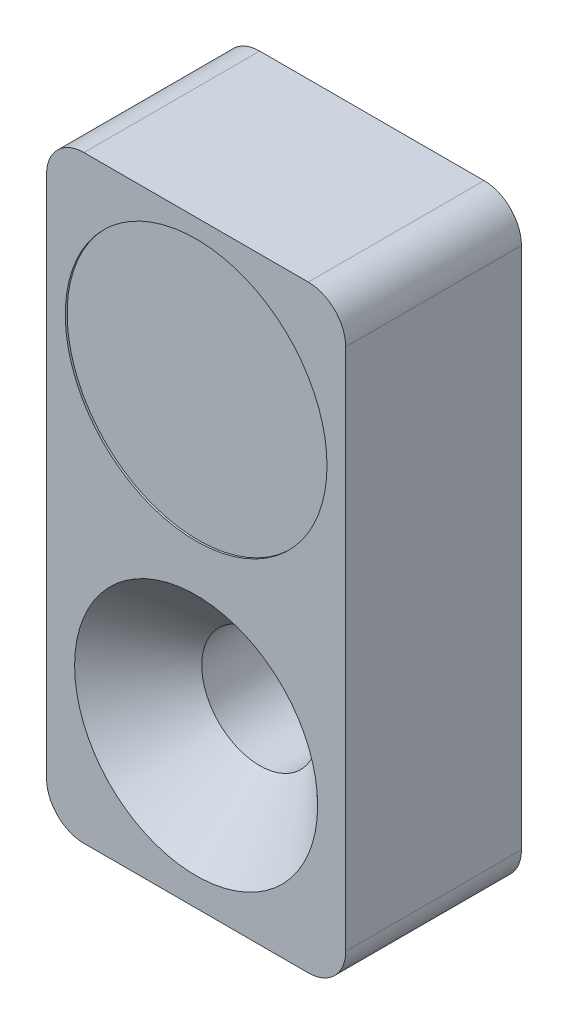
ISO-10303-21;
HEADER;
FILE_DESCRIPTION(('STEP AP214'),'2;1');
FILE_NAME('part.step','',(''),(''),'','','');
FILE_SCHEMA(('AUTOMOTIVE_DESIGN { 1 0 10303 214 1 1 1 1 }'));
ENDSEC;
DATA;
#1=APPLICATION_CONTEXT('core data for automotive mechanical design processes');
#2=APPLICATION_PROTOCOL_DEFINITION('international standard','automotive_design',2000,#1);
#3=PRODUCT_CONTEXT('',#1,'mechanical');
#4=PRODUCT('Part','Part','',(#3));
#5=PRODUCT_RELATED_PRODUCT_CATEGORY('part','',(#4));
#6=PRODUCT_DEFINITION_FORMATION('','',#4);
#7=PRODUCT_DEFINITION_CONTEXT('part definition',#1,'design');
#8=PRODUCT_DEFINITION('design','',#6,#7);
#9=PRODUCT_DEFINITION_SHAPE('','',#8);
#10=(LENGTH_UNIT() NAMED_UNIT(*) SI_UNIT(.MILLI.,.METRE.));
#11=(NAMED_UNIT(*) PLANE_ANGLE_UNIT() SI_UNIT($,.RADIAN.));
#12=(NAMED_UNIT(*) SI_UNIT($,.STERADIAN.) SOLID_ANGLE_UNIT());
#13=UNCERTAINTY_MEASURE_WITH_UNIT(LENGTH_MEASURE(1.E-05),#10,'distance_accuracy_value','');
#14=(GEOMETRIC_REPRESENTATION_CONTEXT(3) GLOBAL_UNCERTAINTY_ASSIGNED_CONTEXT((#13)) GLOBAL_UNIT_ASSIGNED_CONTEXT((#10,
#11,#12)) REPRESENTATION_CONTEXT('',''));
#15=CARTESIAN_POINT('',(0.,0.,0.));
#16=DIRECTION('',(0.,0.,1.));
#17=DIRECTION('',(1.,0.,0.));
#18=AXIS2_PLACEMENT_3D('',#15,#16,#17);
#19=CARTESIAN_POINT('',(0.,0.,4.7));
#20=DIRECTION('',(0.,0.,1.));
#21=DIRECTION('',(1.,0.,0.));
#22=AXIS2_PLACEMENT_3D('',#19,#20,#21);
#23=PLANE('',#22);
#24=DIRECTION('',(0.,-1.,0.));
#25=VECTOR('',#24,1.);
#26=CARTESIAN_POINT('',(0.,0.,4.7));
#27=LINE('',#26,#25);
#28=CARTESIAN_POINT('',(0.,-1.,4.7));
#29=VERTEX_POINT('',#28);
#30=CARTESIAN_POINT('',(0.,-15.,4.7));
#31=VERTEX_POINT('',#30);
#32=EDGE_CURVE('E139',#29,#31,#27,.T.);
#33=ORIENTED_EDGE('',*,*,#32,.T.);
#34=CARTESIAN_POINT('',(1.,-15.,4.7));
#35=DIRECTION('',(0.,0.,1.));
#36=DIRECTION('',(1.,0.,0.));
#37=AXIS2_PLACEMENT_3D('',#34,#35,#36);
#38=CIRCLE('',#37,1.);
#39=CARTESIAN_POINT('',(1.,-16.,4.7));
#40=VERTEX_POINT('',#39);
#41=EDGE_CURVE('E154',#31,#40,#38,.T.);
#42=ORIENTED_EDGE('',*,*,#41,.T.);
#43=DIRECTION('',(1.,0.,0.));
#44=VECTOR('',#43,1.);
#45=CARTESIAN_POINT('',(0.,-16.,4.7));
#46=LINE('',#45,#44);
#47=CARTESIAN_POINT('',(7.,-16.,4.7));
#48=VERTEX_POINT('',#47);
#49=EDGE_CURVE('E121',#40,#48,#46,.T.);
#50=ORIENTED_EDGE('',*,*,#49,.T.);
#51=CARTESIAN_POINT('',(7.,-15.,4.7));
#52=DIRECTION('',(0.,0.,1.));
#53=DIRECTION('',(1.,0.,0.));
#54=AXIS2_PLACEMENT_3D('',#51,#52,#53);
#55=CIRCLE('',#54,1.);
#56=CARTESIAN_POINT('',(8.,-15.,4.7));
#57=VERTEX_POINT('',#56);
#58=EDGE_CURVE('E152',#48,#57,#55,.T.);
#59=ORIENTED_EDGE('',*,*,#58,.T.);
#60=DIRECTION('',(0.,1.,0.));
#61=VECTOR('',#60,1.);
#62=CARTESIAN_POINT('',(8.,0.,4.7));
#63=LINE('',#62,#61);
#64=CARTESIAN_POINT('',(8.,-1.,4.7));
#65=VERTEX_POINT('',#64);
#66=EDGE_CURVE('E174',#57,#65,#63,.T.);
#67=ORIENTED_EDGE('',*,*,#66,.T.);
#68=CARTESIAN_POINT('',(7.,-1.,4.7));
#69=DIRECTION('',(0.,0.,1.));
#70=DIRECTION('',(1.,0.,0.));
#71=AXIS2_PLACEMENT_3D('',#68,#69,#70);
#72=CIRCLE('',#71,1.);
#73=CARTESIAN_POINT('',(7.,0.,4.7));
#74=VERTEX_POINT('',#73);
#75=EDGE_CURVE('E56',#65,#74,#72,.T.);
#76=ORIENTED_EDGE('',*,*,#75,.T.);
#77=DIRECTION('',(-1.,0.,0.));
#78=VECTOR('',#77,1.);
#79=CARTESIAN_POINT('',(0.,0.,4.7));
#80=LINE('',#79,#78);
#81=CARTESIAN_POINT('',(1.,0.,4.7));
#82=VERTEX_POINT('',#81);
#83=EDGE_CURVE('E140',#74,#82,#80,.T.);
#84=ORIENTED_EDGE('',*,*,#83,.T.);
#85=CARTESIAN_POINT('',(1.,-1.,4.7));
#86=DIRECTION('',(0.,0.,1.));
#87=DIRECTION('',(1.,0.,0.));
#88=AXIS2_PLACEMENT_3D('',#85,#86,#87);
#89=CIRCLE('',#88,1.);
#90=EDGE_CURVE('E150',#82,#29,#89,.T.);
#91=ORIENTED_EDGE('',*,*,#90,.T.);
#92=EDGE_LOOP('',(#33,#42,#50,#59,#67,#76,#84,#91));
#93=FACE_BOUND('',#92,.T.);
#94=CARTESIAN_POINT('',(4.,-4.,4.7));
#95=DIRECTION('',(0.,0.,1.));
#96=DIRECTION('',(1.,0.,0.));
#97=AXIS2_PLACEMENT_3D('',#94,#95,#96);
#98=CIRCLE('',#97,3.5);
#99=CARTESIAN_POINT('',(7.5,-4.,4.7));
#100=VERTEX_POINT('',#99);
#101=EDGE_CURVE('E177',#100,#100,#98,.T.);
#102=ORIENTED_EDGE('',*,*,#101,.F.);
#103=EDGE_LOOP('',(#102));
#104=FACE_BOUND('',#103,.T.);
#105=CARTESIAN_POINT('',(4.,-12.,4.7));
#106=DIRECTION('',(0.,0.,1.));
#107=DIRECTION('',(1.,0.,0.));
#108=AXIS2_PLACEMENT_3D('',#105,#106,#107);
#109=CIRCLE('',#108,3.25);
#110=CARTESIAN_POINT('',(7.25,-12.,4.7));
#111=VERTEX_POINT('',#110);
#112=EDGE_CURVE('E188',#111,#111,#109,.T.);
#113=ORIENTED_EDGE('',*,*,#112,.F.);
#114=EDGE_LOOP('',(#113));
#115=FACE_BOUND('',#114,.T.);
#116=ADVANCED_FACE('F36',(#93,#104,#115),#23,.T.);
#117=CARTESIAN_POINT('',(0.,0.,0.));
#118=DIRECTION('',(0.,0.,1.));
#119=DIRECTION('',(1.,0.,0.));
#120=AXIS2_PLACEMENT_3D('',#117,#118,#119);
#121=PLANE('',#120);
#122=DIRECTION('',(1.,0.,0.));
#123=VECTOR('',#122,1.);
#124=CARTESIAN_POINT('',(0.,-16.,0.));
#125=LINE('',#124,#123);
#126=CARTESIAN_POINT('',(1.,-16.,0.));
#127=VERTEX_POINT('',#126);
#128=CARTESIAN_POINT('',(7.,-16.,0.));
#129=VERTEX_POINT('',#128);
#130=EDGE_CURVE('E118',#127,#129,#125,.T.);
#131=ORIENTED_EDGE('',*,*,#130,.F.);
#132=CARTESIAN_POINT('',(1.,-15.,0.));
#133=DIRECTION('',(0.,0.,1.));
#134=DIRECTION('',(1.,0.,0.));
#135=AXIS2_PLACEMENT_3D('',#132,#133,#134);
#136=CIRCLE('',#135,1.);
#137=CARTESIAN_POINT('',(0.,-15.,0.));
#138=VERTEX_POINT('',#137);
#139=EDGE_CURVE('E101',#127,#138,#136,.F.);
#140=ORIENTED_EDGE('',*,*,#139,.T.);
#141=DIRECTION('',(0.,-1.,0.));
#142=VECTOR('',#141,1.);
#143=CARTESIAN_POINT('',(0.,0.,0.));
#144=LINE('',#143,#142);
#145=CARTESIAN_POINT('',(0.,-1.,0.));
#146=VERTEX_POINT('',#145);
#147=EDGE_CURVE('E129',#146,#138,#144,.T.);
#148=ORIENTED_EDGE('',*,*,#147,.F.);
#149=CARTESIAN_POINT('',(1.,-1.,0.));
#150=DIRECTION('',(0.,0.,1.));
#151=DIRECTION('',(1.,0.,0.));
#152=AXIS2_PLACEMENT_3D('',#149,#150,#151);
#153=CIRCLE('',#152,1.);
#154=CARTESIAN_POINT('',(1.,0.,0.));
#155=VERTEX_POINT('',#154);
#156=EDGE_CURVE('E143',#146,#155,#153,.F.);
#157=ORIENTED_EDGE('',*,*,#156,.T.);
#158=DIRECTION('',(-1.,0.,0.));
#159=VECTOR('',#158,1.);
#160=CARTESIAN_POINT('',(0.,0.,0.));
#161=LINE('',#160,#159);
#162=CARTESIAN_POINT('',(7.,0.,0.));
#163=VERTEX_POINT('',#162);
#164=EDGE_CURVE('E132',#163,#155,#161,.T.);
#165=ORIENTED_EDGE('',*,*,#164,.F.);
#166=CARTESIAN_POINT('',(7.,-1.,0.));
#167=DIRECTION('',(0.,0.,1.));
#168=DIRECTION('',(1.,0.,0.));
#169=AXIS2_PLACEMENT_3D('',#166,#167,#168);
#170=CIRCLE('',#169,1.);
#171=CARTESIAN_POINT('',(8.,-1.,0.));
#172=VERTEX_POINT('',#171);
#173=EDGE_CURVE('E122',#163,#172,#170,.F.);
#174=ORIENTED_EDGE('',*,*,#173,.T.);
#175=DIRECTION('',(0.,1.,0.));
#176=VECTOR('',#175,1.);
#177=CARTESIAN_POINT('',(8.,0.,0.));
#178=LINE('',#177,#176);
#179=CARTESIAN_POINT('',(8.,-15.,0.));
#180=VERTEX_POINT('',#179);
#181=EDGE_CURVE('E128',#180,#172,#178,.T.);
#182=ORIENTED_EDGE('',*,*,#181,.F.);
#183=CARTESIAN_POINT('',(7.,-15.,0.));
#184=DIRECTION('',(0.,0.,1.));
#185=DIRECTION('',(1.,0.,0.));
#186=AXIS2_PLACEMENT_3D('',#183,#184,#185);
#187=CIRCLE('',#186,1.);
#188=EDGE_CURVE('E112',#180,#129,#187,.F.);
#189=ORIENTED_EDGE('',*,*,#188,.T.);
#190=EDGE_LOOP('',(#131,#140,#148,#157,#165,#174,#182,#189));
#191=FACE_BOUND('',#190,.T.);
#192=CARTESIAN_POINT('',(4.,-12.,0.));
#193=DIRECTION('',(0.,0.,1.));
#194=DIRECTION('',(1.,0.,0.));
#195=AXIS2_PLACEMENT_3D('',#192,#193,#194);
#196=CIRCLE('',#195,1.55);
#197=CARTESIAN_POINT('',(5.55,-12.,0.));
#198=VERTEX_POINT('',#197);
#199=EDGE_CURVE('E193',#198,#198,#196,.T.);
#200=ORIENTED_EDGE('',*,*,#199,.T.);
#201=EDGE_LOOP('',(#200));
#202=FACE_BOUND('',#201,.T.);
#203=ADVANCED_FACE('F125',(#191,#202),#121,.F.);
#204=CARTESIAN_POINT('',(0.,0.,4.7));
#205=DIRECTION('',(1.,0.,0.));
#206=DIRECTION('',(0.,1.,0.));
#207=AXIS2_PLACEMENT_3D('',#204,#205,#206);
#208=PLANE('',#207);
#209=ORIENTED_EDGE('',*,*,#147,.T.);
#210=DIRECTION('',(0.,0.,-1.));
#211=VECTOR('',#210,1.);
#212=CARTESIAN_POINT('',(0.,-15.,4.7));
#213=LINE('',#212,#211);
#214=EDGE_CURVE('E106',#138,#31,#213,.F.);
#215=ORIENTED_EDGE('',*,*,#214,.T.);
#216=ORIENTED_EDGE('',*,*,#32,.F.);
#217=DIRECTION('',(0.,0.,-1.));
#218=VECTOR('',#217,1.);
#219=CARTESIAN_POINT('',(0.,-1.,4.7));
#220=LINE('',#219,#218);
#221=EDGE_CURVE('E111',#29,#146,#220,.T.);
#222=ORIENTED_EDGE('',*,*,#221,.T.);
#223=EDGE_LOOP('',(#209,#215,#216,#222));
#224=FACE_BOUND('',#223,.T.);
#225=ADVANCED_FACE('F171',(#224),#208,.F.);
#226=CARTESIAN_POINT('',(0.,-16.,4.7));
#227=DIRECTION('',(0.,1.,0.));
#228=DIRECTION('',(0.,0.,1.));
#229=AXIS2_PLACEMENT_3D('',#226,#227,#228);
#230=PLANE('',#229);
#231=ORIENTED_EDGE('',*,*,#49,.F.);
#232=DIRECTION('',(0.,0.,-1.));
#233=VECTOR('',#232,1.);
#234=CARTESIAN_POINT('',(1.,-16.,4.7));
#235=LINE('',#234,#233);
#236=EDGE_CURVE('E105',#40,#127,#235,.T.);
#237=ORIENTED_EDGE('',*,*,#236,.T.);
#238=ORIENTED_EDGE('',*,*,#130,.T.);
#239=DIRECTION('',(0.,0.,-1.));
#240=VECTOR('',#239,1.);
#241=CARTESIAN_POINT('',(7.,-16.,4.7));
#242=LINE('',#241,#240);
#243=EDGE_CURVE('E123',#129,#48,#242,.F.);
#244=ORIENTED_EDGE('',*,*,#243,.T.);
#245=EDGE_LOOP('',(#231,#237,#238,#244));
#246=FACE_BOUND('',#245,.T.);
#247=ADVANCED_FACE('F117',(#246),#230,.F.);
#248=CARTESIAN_POINT('',(8.,0.,4.7));
#249=DIRECTION('',(-1.,0.,0.));
#250=DIRECTION('',(0.,-1.,0.));
#251=AXIS2_PLACEMENT_3D('',#248,#249,#250);
#252=PLANE('',#251);
#253=ORIENTED_EDGE('',*,*,#66,.F.);
#254=DIRECTION('',(0.,0.,-1.));
#255=VECTOR('',#254,1.);
#256=CARTESIAN_POINT('',(8.,-15.,4.7));
#257=LINE('',#256,#255);
#258=EDGE_CURVE('E158',#57,#180,#257,.T.);
#259=ORIENTED_EDGE('',*,*,#258,.T.);
#260=ORIENTED_EDGE('',*,*,#181,.T.);
#261=DIRECTION('',(0.,0.,-1.));
#262=VECTOR('',#261,1.);
#263=CARTESIAN_POINT('',(8.,-1.,4.7));
#264=LINE('',#263,#262);
#265=EDGE_CURVE('E156',#172,#65,#264,.F.);
#266=ORIENTED_EDGE('',*,*,#265,.T.);
#267=EDGE_LOOP('',(#253,#259,#260,#266));
#268=FACE_BOUND('',#267,.T.);
#269=ADVANCED_FACE('F217',(#268),#252,.F.);
#270=CARTESIAN_POINT('',(0.,0.,4.7));
#271=DIRECTION('',(0.,-1.,0.));
#272=DIRECTION('',(0.,0.,-1.));
#273=AXIS2_PLACEMENT_3D('',#270,#271,#272);
#274=PLANE('',#273);
#275=ORIENTED_EDGE('',*,*,#164,.T.);
#276=DIRECTION('',(0.,0.,-1.));
#277=VECTOR('',#276,1.);
#278=CARTESIAN_POINT('',(1.,0.,4.7));
#279=LINE('',#278,#277);
#280=EDGE_CURVE('E11',#155,#82,#279,.F.);
#281=ORIENTED_EDGE('',*,*,#280,.T.);
#282=ORIENTED_EDGE('',*,*,#83,.F.);
#283=DIRECTION('',(0.,0.,-1.));
#284=VECTOR('',#283,1.);
#285=CARTESIAN_POINT('',(7.,0.,4.7));
#286=LINE('',#285,#284);
#287=EDGE_CURVE('E44',#74,#163,#286,.T.);
#288=ORIENTED_EDGE('',*,*,#287,.T.);
#289=EDGE_LOOP('',(#275,#281,#282,#288));
#290=FACE_BOUND('',#289,.T.);
#291=ADVANCED_FACE('F163',(#290),#274,.F.);
#292=CARTESIAN_POINT('',(1.,-15.,4.7));
#293=DIRECTION('',(0.,0.,-1.));
#294=DIRECTION('',(-1.,0.,0.));
#295=AXIS2_PLACEMENT_3D('',#292,#293,#294);
#296=CYLINDRICAL_SURFACE('',#295,1.);
#297=ORIENTED_EDGE('',*,*,#41,.F.);
#298=ORIENTED_EDGE('',*,*,#214,.F.);
#299=ORIENTED_EDGE('',*,*,#139,.F.);
#300=ORIENTED_EDGE('',*,*,#236,.F.);
#301=EDGE_LOOP('',(#297,#298,#299,#300));
#302=FACE_BOUND('',#301,.T.);
#303=ADVANCED_FACE('F104',(#302),#296,.T.);
#304=CARTESIAN_POINT('',(7.,-15.,4.7));
#305=DIRECTION('',(0.,0.,-1.));
#306=DIRECTION('',(-1.,0.,0.));
#307=AXIS2_PLACEMENT_3D('',#304,#305,#306);
#308=CYLINDRICAL_SURFACE('',#307,1.);
#309=ORIENTED_EDGE('',*,*,#58,.F.);
#310=ORIENTED_EDGE('',*,*,#243,.F.);
#311=ORIENTED_EDGE('',*,*,#188,.F.);
#312=ORIENTED_EDGE('',*,*,#258,.F.);
#313=EDGE_LOOP('',(#309,#310,#311,#312));
#314=FACE_BOUND('',#313,.T.);
#315=ADVANCED_FACE('F227',(#314),#308,.T.);
#316=CARTESIAN_POINT('',(1.,-1.,4.7));
#317=DIRECTION('',(0.,0.,-1.));
#318=DIRECTION('',(-1.,0.,0.));
#319=AXIS2_PLACEMENT_3D('',#316,#317,#318);
#320=CYLINDRICAL_SURFACE('',#319,1.);
#321=ORIENTED_EDGE('',*,*,#90,.F.);
#322=ORIENTED_EDGE('',*,*,#280,.F.);
#323=ORIENTED_EDGE('',*,*,#156,.F.);
#324=ORIENTED_EDGE('',*,*,#221,.F.);
#325=EDGE_LOOP('',(#321,#322,#323,#324));
#326=FACE_BOUND('',#325,.T.);
#327=ADVANCED_FACE('F168',(#326),#320,.T.);
#328=CARTESIAN_POINT('',(7.,-1.,4.7));
#329=DIRECTION('',(0.,0.,-1.));
#330=DIRECTION('',(-1.,0.,0.));
#331=AXIS2_PLACEMENT_3D('',#328,#329,#330);
#332=CYLINDRICAL_SURFACE('',#331,1.);
#333=ORIENTED_EDGE('',*,*,#75,.F.);
#334=ORIENTED_EDGE('',*,*,#265,.F.);
#335=ORIENTED_EDGE('',*,*,#173,.F.);
#336=ORIENTED_EDGE('',*,*,#287,.F.);
#337=EDGE_LOOP('',(#333,#334,#335,#336));
#338=FACE_BOUND('',#337,.T.);
#339=ADVANCED_FACE('F38',(#338),#332,.T.);
#340=CARTESIAN_POINT('',(4.,-4.,4.65));
#341=DIRECTION('',(0.,0.,1.));
#342=DIRECTION('',(1.,0.,0.));
#343=AXIS2_PLACEMENT_3D('',#340,#341,#342);
#344=CYLINDRICAL_SURFACE('',#343,3.5);
#345=CARTESIAN_POINT('',(4.,-4.,4.65));
#346=DIRECTION('',(0.,0.,1.));
#347=DIRECTION('',(1.,0.,0.));
#348=AXIS2_PLACEMENT_3D('',#345,#346,#347);
#349=CIRCLE('',#348,3.5);
#350=CARTESIAN_POINT('',(7.5,-4.,4.65));
#351=VERTEX_POINT('',#350);
#352=EDGE_CURVE('E134',#351,#351,#349,.T.);
#353=ORIENTED_EDGE('',*,*,#352,.F.);
#354=EDGE_LOOP('',(#353));
#355=FACE_BOUND('',#354,.T.);
#356=ORIENTED_EDGE('',*,*,#101,.T.);
#357=EDGE_LOOP('',(#356));
#358=FACE_BOUND('',#357,.T.);
#359=ADVANCED_FACE('F201',(#355,#358),#344,.F.);
#360=CARTESIAN_POINT('',(4.,-4.,4.65));
#361=DIRECTION('',(0.,0.,1.));
#362=DIRECTION('',(1.,0.,0.));
#363=AXIS2_PLACEMENT_3D('',#360,#361,#362);
#364=PLANE('',#363);
#365=ORIENTED_EDGE('',*,*,#352,.T.);
#366=EDGE_LOOP('',(#365));
#367=FACE_BOUND('',#366,.T.);
#368=ADVANCED_FACE('F199',(#367),#364,.T.);
#369=CARTESIAN_POINT('',(4.,-12.,2.99999999999998));
#370=DIRECTION('',(0.,0.,1.));
#371=DIRECTION('',(1.,0.,0.));
#372=AXIS2_PLACEMENT_3D('',#369,#370,#371);
#373=CONICAL_SURFACE('',#372,1.55,0.785398163397443);
#374=ORIENTED_EDGE('',*,*,#112,.T.);
#375=EDGE_LOOP('',(#374));
#376=FACE_BOUND('',#375,.T.);
#377=CARTESIAN_POINT('',(4.,-12.,2.99999999999998));
#378=DIRECTION('',(0.,0.,1.));
#379=DIRECTION('',(1.,0.,0.));
#380=AXIS2_PLACEMENT_3D('',#377,#378,#379);
#381=CIRCLE('',#380,1.55);
#382=CARTESIAN_POINT('',(5.55,-12.,2.99999999999998));
#383=VERTEX_POINT('',#382);
#384=EDGE_CURVE('E190',#383,#383,#381,.T.);
#385=ORIENTED_EDGE('',*,*,#384,.F.);
#386=EDGE_LOOP('',(#385));
#387=FACE_BOUND('',#386,.T.);
#388=ADVANCED_FACE('F209',(#376,#387),#373,.F.);
#389=CARTESIAN_POINT('',(4.,-12.,4.7));
#390=DIRECTION('',(0.,0.,1.));
#391=DIRECTION('',(1.,0.,0.));
#392=AXIS2_PLACEMENT_3D('',#389,#390,#391);
#393=CYLINDRICAL_SURFACE('',#392,1.55);
#394=ORIENTED_EDGE('',*,*,#384,.T.);
#395=EDGE_LOOP('',(#394));
#396=FACE_BOUND('',#395,.T.);
#397=ORIENTED_EDGE('',*,*,#199,.F.);
#398=EDGE_LOOP('',(#397));
#399=FACE_BOUND('',#398,.T.);
#400=ADVANCED_FACE('F271',(#396,#399),#393,.F.);
#401=CLOSED_SHELL('',(#116,#203,#225,#247,#269,#291,#303,#315,#327,#339,#359,#368,#388,#400));
#402=MANIFOLD_SOLID_BREP('B2',#401);
#403=ADVANCED_BREP_SHAPE_REPRESENTATION('',(#18,#402),#14);
#404=SHAPE_DEFINITION_REPRESENTATION(#9,#403);
ENDSEC;
END-ISO-10303-21;
